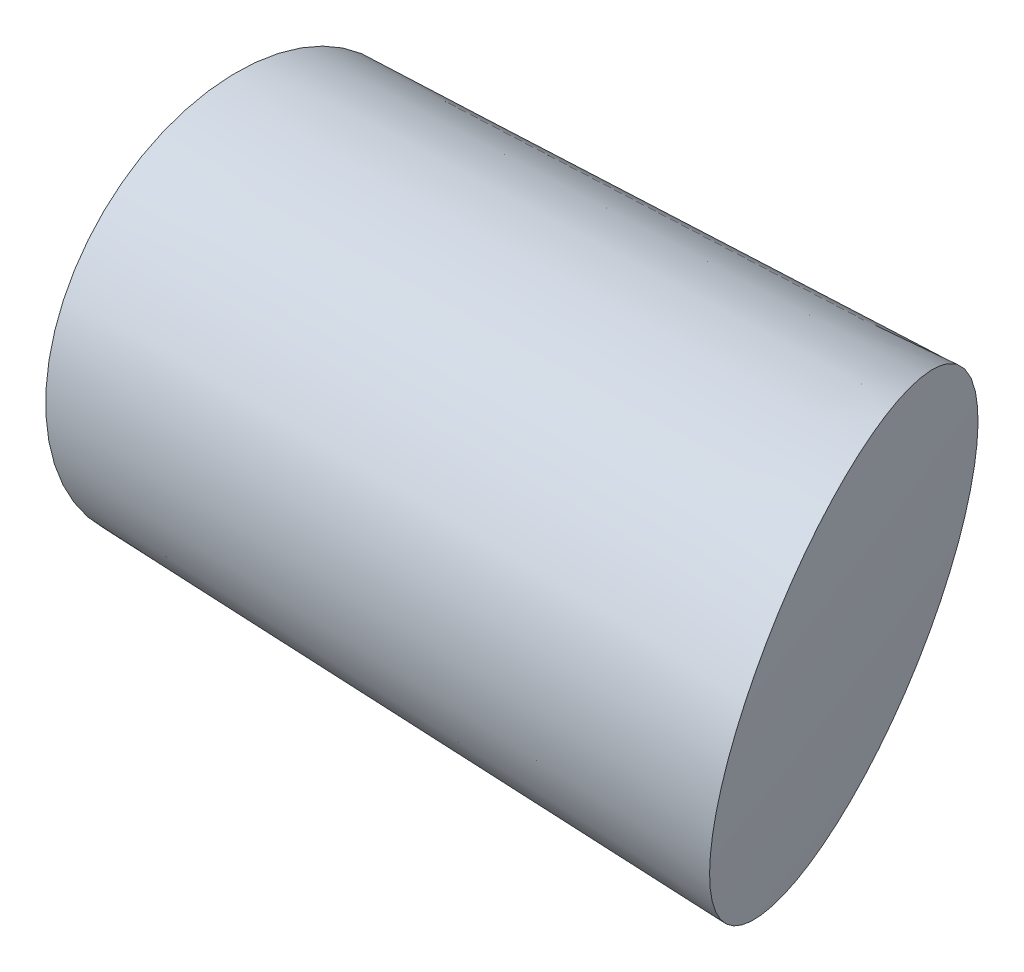
ISO-10303-21;
HEADER;
FILE_DESCRIPTION(('STEP AP214'),'2;1');
FILE_NAME('part.step','',(''),(''),'','','');
FILE_SCHEMA(('AUTOMOTIVE_DESIGN { 1 0 10303 214 1 1 1 1 }'));
ENDSEC;
DATA;
#1=APPLICATION_CONTEXT('core data for automotive mechanical design processes');
#2=APPLICATION_PROTOCOL_DEFINITION('international standard','automotive_design',2000,#1);
#3=PRODUCT_CONTEXT('',#1,'mechanical');
#4=PRODUCT('Part','Part','',(#3));
#5=PRODUCT_RELATED_PRODUCT_CATEGORY('part','',(#4));
#6=PRODUCT_DEFINITION_FORMATION('','',#4);
#7=PRODUCT_DEFINITION_CONTEXT('part definition',#1,'design');
#8=PRODUCT_DEFINITION('design','',#6,#7);
#9=PRODUCT_DEFINITION_SHAPE('','',#8);
#10=(LENGTH_UNIT() NAMED_UNIT(*) SI_UNIT(.MILLI.,.METRE.));
#11=(NAMED_UNIT(*) PLANE_ANGLE_UNIT() SI_UNIT($,.RADIAN.));
#12=(NAMED_UNIT(*) SI_UNIT($,.STERADIAN.) SOLID_ANGLE_UNIT());
#13=UNCERTAINTY_MEASURE_WITH_UNIT(LENGTH_MEASURE(1.E-05),#10,'distance_accuracy_value','');
#14=(GEOMETRIC_REPRESENTATION_CONTEXT(3) GLOBAL_UNCERTAINTY_ASSIGNED_CONTEXT((#13)) GLOBAL_UNIT_ASSIGNED_CONTEXT((#10,
#11,#12)) REPRESENTATION_CONTEXT('',''));
#15=CARTESIAN_POINT('',(0.,0.,0.));
#16=DIRECTION('',(0.,0.,1.));
#17=DIRECTION('',(1.,0.,0.));
#18=AXIS2_PLACEMENT_3D('',#15,#16,#17);
#19=CARTESIAN_POINT('',(179.320337841359,95.7593495012203,0.184037288881903));
#20=CARTESIAN_POINT('',(179.320239723515,95.760214114572,0.122691525921269));
#21=CARTESIAN_POINT('',(179.320141605671,95.7610787279237,0.0613457629606337));
#22=CARTESIAN_POINT('',(179.310231703382,95.8484046764461,-6.13457629606349));
#23=CARTESIAN_POINT('',(178.476616058903,95.9749337579072,-9.08435945500562));
#24=CARTESIAN_POINT('',(175.97364788942,96.1051535254976,-10.009742754146));
#25=CARTESIAN_POINT('',(175.947295778844,96.1065245240411,-10.0194855080976));
#26=CARTESIAN_POINT('',(175.920943668268,96.1078955225846,-10.0292282620493));
#27=CARTESIAN_POINT('',(179.31685623577,95.5062330008136,0.183936354268494));
#28=CARTESIAN_POINT('',(179.316790823874,95.5068094097147,0.122624236178996));
#29=CARTESIAN_POINT('',(179.316725411977,95.5073858186158,0.0613121180894974));
#30=CARTESIAN_POINT('',(179.310118810451,95.5656031176307,-6.13121180894982));
#31=CARTESIAN_POINT('',(178.471386634521,95.6499558386048,-9.09100481577225));
#32=CARTESIAN_POINT('',(175.973703532429,95.7367690169984,-10.0096720449849));
#33=CARTESIAN_POINT('',(175.947407064862,95.7376830160274,-10.0193440898402));
#34=CARTESIAN_POINT('',(175.921110597295,95.7385970150564,-10.0290161346955));
#35=CARTESIAN_POINT('',(179.313374630181,95.2531165004068,0.183835419655084));
#36=CARTESIAN_POINT('',(179.313341924232,95.2534047048574,0.122556946436723));
#37=CARTESIAN_POINT('',(179.313309218284,95.2536929093079,0.0612784732183612));
#38=CARTESIAN_POINT('',(179.31000591752,95.2828015588154,-6.12784732183616));
#39=CARTESIAN_POINT('',(178.466157210138,95.3249779193024,-9.09765017653888));
#40=CARTESIAN_POINT('',(175.973759175438,95.3683845084992,-10.0096013358238));
#41=CARTESIAN_POINT('',(175.94751835088,95.3688415080137,-10.0192026715828));
#42=CARTESIAN_POINT('',(175.921277526322,95.3692985075282,-10.0288040073418));
#43=CARTESIAN_POINT('',(179.299013007124,94.2090109362289,0.18341906437477));
#44=CARTESIAN_POINT('',(179.299115213212,94.2081102973209,0.122279376249847));
#45=CARTESIAN_POINT('',(179.2992174193,94.2072096584129,0.0611396881249241));
#46=CARTESIAN_POINT('',(179.309540234181,94.1162451287022,-6.11396881249228));
#47=CARTESIAN_POINT('',(178.44458583456,93.98444400218,-9.12506228970122));
#48=CARTESIAN_POINT('',(175.97398870285,93.8487984109399,-10.0093096605343));
#49=CARTESIAN_POINT('',(175.947977405704,93.8473702874572,-10.018619321271));
#50=CARTESIAN_POINT('',(175.921966108558,93.8459421639744,-10.0279289820077));
#51=CARTESIAN_POINT('',(179.297688771262,92.6266734184361,0.186237597628298));
#52=CARTESIAN_POINT('',(179.297920203992,92.6239932699078,0.124158398418865));
#53=CARTESIAN_POINT('',(179.298151636721,92.6213131213796,0.0620791992094317));
#54=CARTESIAN_POINT('',(179.321526342417,92.3506181200275,-6.20791992094334));
#55=CARTESIAN_POINT('',(178.419524826648,91.957927997574,-9.36453261538096));
#56=CARTESIAN_POINT('',(175.97425536124,91.5539518315239,-10.3231837447634));
#57=CARTESIAN_POINT('',(175.948510722484,91.5496986313723,-10.3332767538847));
#58=CARTESIAN_POINT('',(175.922766083729,91.5454454312208,-10.3433697630061));
#59=CARTESIAN_POINT('',(179.35957448773,90.2525842129129,0.196425885249977));
#60=CARTESIAN_POINT('',(179.359765102874,90.2477072970523,0.130950590166652));
#61=CARTESIAN_POINT('',(179.359955718019,90.2428303811917,0.0654752950833268));
#62=CARTESIAN_POINT('',(179.379207847659,89.7502618792728,-6.54752950833252));
#63=CARTESIAN_POINT('',(178.405692528753,89.0037801383462,-10.065051511361));
#64=CARTESIAN_POINT('',(175.974402542004,88.2471998346621,-11.3366020123975));
#65=CARTESIAN_POINT('',(175.948805084012,88.2392342967599,-11.3499893338243));
#66=CARTESIAN_POINT('',(175.923207626021,88.2312687588576,-11.3633766552512));
#67=CARTESIAN_POINT('',(179.487896947503,87.8798833437328,0.210046179333926));
#68=CARTESIAN_POINT('',(179.487802986571,87.8731973423953,0.140030786222618));
#69=CARTESIAN_POINT('',(179.487709025639,87.8665113410579,0.0700153931113102));
#70=CARTESIAN_POINT('',(179.478218971518,87.1912252059778,-7.0015393111308));
#71=CARTESIAN_POINT('',(178.416509975362,86.122113444057,-10.9614290022923));
#72=CARTESIAN_POINT('',(175.974287440373,85.0541063391589,-12.6619599836971));
#73=CARTESIAN_POINT('',(175.948574880749,85.0428619926798,-12.6798637593048));
#74=CARTESIAN_POINT('',(175.922862321126,85.0316176462006,-12.6977675349125));
#75=CARTESIAN_POINT('',(179.749317080231,84.7211682382065,0.231093606619197));
#76=CARTESIAN_POINT('',(179.748512625675,84.7124685048417,0.154062404412798));
#77=CARTESIAN_POINT('',(179.74770817112,84.7037687714769,0.0770312022063989));
#78=CARTESIAN_POINT('',(179.666458260988,83.8250957016303,-7.7031202206399));
#79=CARTESIAN_POINT('',(178.46437823144,82.3584566862005,-12.3206657414968));
#80=CARTESIAN_POINT('',(175.973778104429,80.9179479678816,-14.6910031946837));
#81=CARTESIAN_POINT('',(175.947556208862,80.9027817961766,-14.7159589234181));
#82=CARTESIAN_POINT('',(175.921334313295,80.8876156244716,-14.7409146521525));
#83=CARTESIAN_POINT('',(180.14883428544,81.5743967974306,0.254913355292645));
#84=CARTESIAN_POINT('',(180.14681367768,81.5640823883875,0.169942236861764));
#85=CARTESIAN_POINT('',(180.144793069921,81.5537679793444,0.0849711184308833));
#86=CARTESIAN_POINT('',(179.940711686194,80.5120126659906,-8.49711184308807));
#87=CARTESIAN_POINT('',(178.563281980309,78.6819541971733,-13.8365350812361));
#88=CARTESIAN_POINT('',(175.972725731972,76.9126969276965,-16.9708678022374));
#89=CARTESIAN_POINT('',(175.945451463949,76.8940695780679,-17.0038671361692));
#90=CARTESIAN_POINT('',(175.918177195925,76.8754422284392,-17.0368664701009));
#91=CARTESIAN_POINT('',(180.682957076427,78.4478025029072,0.280054343935183));
#92=CARTESIAN_POINT('',(180.679228120871,78.4360394499658,0.186702895956789));
#93=CARTESIAN_POINT('',(180.675499165314,78.4242763970243,0.0933514479783945));
#94=CARTESIAN_POINT('',(180.298874654083,77.2362080499361,-9.3351447978394));
#95=CARTESIAN_POINT('',(178.711796467482,75.0590430997608,-15.4259875601082));
#96=CARTESIAN_POINT('',(175.971145482917,72.9806694682737,-19.3694878297363));
#97=CARTESIAN_POINT('',(175.942290965837,72.9587876351675,-19.4110063581891));
#98=CARTESIAN_POINT('',(175.913436448758,72.9369058020612,-19.4525248866418));
#99=CARTESIAN_POINT('',(181.146739635946,76.1140332129099,0.299501106901493));
#100=CARTESIAN_POINT('',(181.141498437257,76.1012474988851,0.199667404600996));
#101=CARTESIAN_POINT('',(181.136257238568,76.0884617848602,0.0998337023004997));
#102=CARTESIAN_POINT('',(180.606896170939,74.797104668346,-9.98337023004968));
#103=CARTESIAN_POINT('',(178.846456636891,72.3661585156109,-16.6509857151081));
#104=CARTESIAN_POINT('',(175.969712648924,70.0636812616895,-21.2215700348593));
#105=CARTESIAN_POINT('',(175.939425297853,70.0394399884949,-21.2696907200756));
#106=CARTESIAN_POINT('',(175.909137946782,70.0151987153004,-21.317811405292));
#107=CARTESIAN_POINT('',(181.669600335133,73.7926606125094,0.319207371721182));
#108=CARTESIAN_POINT('',(181.662631026038,73.7788527315476,0.212804914480788));
#109=CARTESIAN_POINT('',(181.655661716943,73.7650448505858,0.106402457240395));
#110=CARTESIAN_POINT('',(180.951761498333,72.3704488734477,-10.6402457240393));
#111=CARTESIAN_POINT('',(179.002860045207,69.6874526294797,-17.8899295846978));
#112=CARTESIAN_POINT('',(175.968048458831,67.1620626324504,-23.0966049891868));
#113=CARTESIAN_POINT('',(175.936096917666,67.135474457155,-23.151422660328));
#114=CARTESIAN_POINT('',(175.904145376502,67.1088862818597,-23.2062403314692));
#115=CARTESIAN_POINT('',(182.435255657851,70.7137830284242,0.344992255778418));
#116=CARTESIAN_POINT('',(182.425731867935,70.6984333356769,0.229994837185612));
#117=CARTESIAN_POINT('',(182.416208078019,70.6830836429297,0.114997418592806));
#118=CARTESIAN_POINT('',(181.454305296507,69.1327646754583,-11.4997418592806));
#119=CARTESIAN_POINT('',(179.236613881136,66.102666797379,-19.5124736250272));
#120=CARTESIAN_POINT('',(175.965561231588,63.2633082710742,-25.5510678667283));
#121=CARTESIAN_POINT('',(175.931122463181,63.2334145270139,-25.6146442657893));
#122=CARTESIAN_POINT('',(175.896683694773,63.2035207829536,-25.6782206648503));
#123=CARTESIAN_POINT('',(183.501533426331,66.8952690777941,0.374524402186752));
#124=CARTESIAN_POINT('',(183.488417452522,66.8773190281757,0.249682934791168));
#125=CARTESIAN_POINT('',(183.475301478714,66.8593689785573,0.124841467395585));
#126=CARTESIAN_POINT('',(182.150588124061,65.0464139670973,-12.4841467395583));
#127=CARTESIAN_POINT('',(179.569007921936,61.5366653409081,-21.3833928959682));
#128=CARTESIAN_POINT('',(175.962024436094,58.2389600045546,-28.3714598808113));
#129=CARTESIAN_POINT('',(175.924048872192,58.2042406274847,-28.4450326557835));
#130=CARTESIAN_POINT('',(175.886073308291,58.1695212504149,-28.5186054307556));
#131=CARTESIAN_POINT('',(184.863636662741,62.3401215379093,0.404558842889708));
#132=CARTESIAN_POINT('',(184.845907397354,62.3180160374998,0.269705895259806));
#133=CARTESIAN_POINT('',(184.828178131967,62.2959105370903,0.134852947629903));
#134=CARTESIAN_POINT('',(183.037522327883,60.0632549957304,-13.4852947629902));
#135=CARTESIAN_POINT('',(179.998460884842,55.9060414516423,-23.3153582527551));
#136=CARTESIAN_POINT('',(175.957454897782,51.9559982641663,-31.2612678292801));
#137=CARTESIAN_POINT('',(175.914909795568,51.9144108496219,-31.3449251008104));
#138=CARTESIAN_POINT('',(175.872364693354,51.8728234350775,-31.4285823723407));
#139=CARTESIAN_POINT('',(185.979193006329,58.540308371435,0.424046298602275));
#140=CARTESIAN_POINT('',(185.957688824085,58.5139999864224,0.282697532401517));
#141=CARTESIAN_POINT('',(185.93618464184,58.4876916014099,0.141348766200758));
#142=CARTESIAN_POINT('',(183.764262235122,55.8305447151425,-14.1348766200758));
#143=CARTESIAN_POINT('',(180.349519501158,51.0813708850248,-24.6054585942461));
#144=CARTESIAN_POINT('',(175.953719504303,46.5138753127562,-33.1631175824054));
#145=CARTESIAN_POINT('',(175.907439008611,46.4657871469367,-33.2532155623461));
#146=CARTESIAN_POINT('',(175.861158512918,46.4176989811172,-33.3433135422868));
#147=CARTESIAN_POINT('',(186.768986149782,55.4735899432799,0.435382914505368));
#148=CARTESIAN_POINT('',(186.744834329219,55.4436077109046,0.290255276336913));
#149=CARTESIAN_POINT('',(186.720682508656,55.4136254785292,0.145127638168459));
#150=CARTESIAN_POINT('',(184.281348631834,52.385420008619,-14.5127638168454));
#151=CARTESIAN_POINT('',(180.593136877377,47.1400205183786,-25.3926490957045));
#152=CARTESIAN_POINT('',(175.951127325345,42.0470775805006,-34.2964207508572));
#153=CARTESIAN_POINT('',(175.902254650693,41.9934573239222,-34.3901627241109));
#154=CARTESIAN_POINT('',(175.853381976042,41.9398370673437,-34.4839046973646));
#155=CARTESIAN_POINT('',(187.455182311421,52.3830961194043,0.443476779985051));
#156=CARTESIAN_POINT('',(187.428758842578,52.3492982635544,0.295651186656701));
#157=CARTESIAN_POINT('',(187.402335373735,52.3155004077046,0.147825593328351));
#158=CARTESIAN_POINT('',(184.733565020598,48.9019169668697,-14.782559332835));
#159=CARTESIAN_POINT('',(180.799129164578,43.1496982976652,-25.9933016684416));
#160=CARTESIAN_POINT('',(175.948935491245,37.5167893715027,-35.1339000188614));
#161=CARTESIAN_POINT('',(175.897870982494,37.4574841671075,-35.2301353850943));
#162=CARTESIAN_POINT('',(175.846806473743,37.3981789627123,-35.3263707513273));
#163=CARTESIAN_POINT('',(188.105508117851,48.4791458825052,0.446750483580614));
#164=CARTESIAN_POINT('',(188.07699835425,48.4403828032049,0.29783365572041));
#165=CARTESIAN_POINT('',(188.048488590649,48.4016197239047,0.148916827860206));
#166=CARTESIAN_POINT('',(185.169002466931,44.4865487145831,-14.8916827860204));
#167=CARTESIAN_POINT('',(180.981195144611,38.0855142895933,-26.3507123663262));
#168=CARTESIAN_POINT('',(175.9469982419,31.7571571547851,-35.5566302697493));
#169=CARTESIAN_POINT('',(175.893996483804,31.69053003223,-35.6535533427236));
#170=CARTESIAN_POINT('',(175.840994725708,31.6239029096748,-35.7504764156979));
#171=CARTESIAN_POINT('',(188.536021323112,43.7497341824,0.436876927798753));
#172=CARTESIAN_POINT('',(188.506280141374,43.7052317407423,0.291251285199171));
#173=CARTESIAN_POINT('',(188.476538959636,43.6607292990847,0.145625642599588));
#174=CARTESIAN_POINT('',(185.472679604097,39.1659826916659,-14.5625642599583));
#175=CARTESIAN_POINT('',(181.072147740157,31.9988994335269,-25.9869351945906));
#176=CARTESIAN_POINT('',(175.946030472654,24.8558460727332,-34.8057447462999));
#177=CARTESIAN_POINT('',(175.892060945313,24.7806415478385,-34.898592209279));
#178=CARTESIAN_POINT('',(175.838091417971,24.7054370229437,-34.991439672258));
#179=CARTESIAN_POINT('',(188.621293593446,38.9985715914568,0.41102705648737));
#180=CARTESIAN_POINT('',(188.591577916748,38.9495517914533,0.274018037658249));
#181=CARTESIAN_POINT('',(188.561862240049,38.9005319914499,0.137009018829127));
#182=CARTESIAN_POINT('',(185.560578893477,33.9495321911022,-13.7009018829121));
#183=CARTESIAN_POINT('',(181.036938483305,26.1001875986502,-24.7062954566062));
#184=CARTESIAN_POINT('',(175.946405112165,18.2625158538362,-32.5989915431999));
#185=CARTESIAN_POINT('',(175.892810224335,18.1799981474608,-32.6820885647887));
#186=CARTESIAN_POINT('',(175.839215336505,18.0974804410853,-32.7651855863774));
#187=CARTESIAN_POINT('',(188.384141922687,34.2455000702239,0.369503390993638));
#188=CARTESIAN_POINT('',(188.355627526485,34.1944133754301,0.246335593995761));
#189=CARTESIAN_POINT('',(188.327113130284,34.1433266806363,0.123167796997883));
#190=CARTESIAN_POINT('',(185.447159113934,28.9835705064628,-12.3167796997878));
#191=CARTESIAN_POINT('',(180.883525634274,20.6233994174228,-22.5272063493302));
#192=CARTESIAN_POINT('',(175.948037481602,12.3341992724398,-28.964710267299));
#193=CARTESIAN_POINT('',(175.896074963209,12.2469277196214,-29.0324865247628));
#194=CARTESIAN_POINT('',(175.844112444815,12.159656166803,-29.1002627822267));
#195=CARTESIAN_POINT('',(187.858184577812,29.5059742198807,0.315411089303516));
#196=CARTESIAN_POINT('',(187.831926916091,29.4560307106992,0.210274059535679));
#197=CARTESIAN_POINT('',(187.80566925437,29.4060872015178,0.105137029767843));
#198=CARTESIAN_POINT('',(185.153645420517,24.3617927741863,-10.5137029767837));
#199=CARTESIAN_POINT('',(180.623784828973,15.7157797145001,-19.6294449974072));
#200=CARTESIAN_POINT('',(175.950801219808,7.29377015944779,-24.1870197107629));
#201=CARTESIAN_POINT('',(175.90160243962,7.20510034343837,-24.2350034263644));
#202=CARTESIAN_POINT('',(175.852403659432,7.11643052742894,-24.2829871419658));
#203=CARTESIAN_POINT('',(187.080619573174,24.7911792432987,0.252644900952354));
#204=CARTESIAN_POINT('',(187.057540795512,24.7456044231843,0.168429933968238));
#205=CARTESIAN_POINT('',(187.034462017851,24.7000296030698,0.0842149669841222));
#206=CARTESIAN_POINT('',(184.70350547405,20.0969727715102,-8.42149669841161));
#207=CARTESIAN_POINT('',(180.270889996125,11.3895287702404,-16.238249857114));
#208=CARTESIAN_POINT('',(175.954556151309,3.15384657224501,-18.6220997672373));
#209=CARTESIAN_POINT('',(175.909112302623,3.06713847479691,-18.6471977597702));
#210=CARTESIAN_POINT('',(175.863668453937,2.9804303773488,-18.6722957523031));
#211=CARTESIAN_POINT('',(186.418552881704,21.6691348919108,0.207079090190809));
#212=CARTESIAN_POINT('',(186.398121977882,21.6283569833582,0.138052726793874));
#213=CARTESIAN_POINT('',(186.37769107406,21.5875790748056,0.0690263633969403));
#214=CARTESIAN_POINT('',(184.31416978805,17.4690103109952,-6.90263633969341));
#215=CARTESIAN_POINT('',(179.982034606823,8.84975260740575,-13.7678189913936));
#216=CARTESIAN_POINT('',(175.957629679454,0.923414611188425,-14.5759065021019));
#217=CARTESIAN_POINT('',(175.915259358911,0.839963395993413,-14.5844143256119));
#218=CARTESIAN_POINT('',(175.872889038369,0.756512180798402,-14.5929221491219));
#219=CARTESIAN_POINT('',(186.056982227848,20.1139644556955,0.183706863396939));
#220=CARTESIAN_POINT('',(186.037988151899,20.075976303797,0.122471242264628));
#221=CARTESIAN_POINT('',(186.018994075949,20.0379881518985,0.0612356211323165));
#222=CARTESIAN_POINT('',(184.100592405073,16.2011848101491,-6.12356211323112));
#223=CARTESIAN_POINT('',(179.82610913476,7.65221826952447,-12.5));
#224=CARTESIAN_POINT('',(175.959288784129,-0.0814224317345808,-12.5));
#225=CARTESIAN_POINT('',(175.918577568261,-0.162844863469092,-12.5));
#226=CARTESIAN_POINT('',(175.877866352394,-0.244267295203604,-12.5));
#227=B_SPLINE_SURFACE_WITH_KNOTS('',3,3,((#19,#20,#21,#22,#23,#24,#25,#26),(#27,#28,#29,#30,#31,
#32,#33,#34),(#35,#36,#37,#38,#39,#40,#41,#42),(#43,#44,#45,#46,#47,#48,#49,#50),(#51,#52,#53,
#54,#55,#56,#57,#58),(#59,#60,#61,#62,#63,#64,#65,#66),(#67,#68,#69,#70,#71,#72,#73,#74),(#75,
#76,#77,#78,#79,#80,#81,#82),(#83,#84,#85,#86,#87,#88,#89,#90),(#91,#92,#93,#94,#95,#96,#97,
#98),(#99,#100,#101,#102,#103,#104,#105,#106),(#107,#108,#109,#110,#111,#112,#113,#114),(#115,
#116,#117,#118,#119,#120,#121,#122),(#123,#124,#125,#126,#127,#128,#129,#130),(#131,#132,#133,
#134,#135,#136,#137,#138),(#139,#140,#141,#142,#143,#144,#145,#146),(#147,#148,#149,#150,#151,
#152,#153,#154),(#155,#156,#157,#158,#159,#160,#161,#162),(#163,#164,#165,#166,#167,#168,#169,
#170),(#171,#172,#173,#174,#175,#176,#177,#178),(#179,#180,#181,#182,#183,#184,#185,#186),(#187,
#188,#189,#190,#191,#192,#193,#194),(#195,#196,#197,#198,#199,#200,#201,#202),(#203,#204,#205,
#206,#207,#208,#209,#210),(#211,#212,#213,#214,#215,#216,#217,#218),(#219,#220,#221,#222,#223,
#224,#225,#226)),.UNSPECIFIED.,.F.,.F.,.F.,(4,2,1,1,1,1,1,1,1,1,1,1,1,1,1,1,1,1,1,1,1,1,4),(4,2,
2,4),(-0.01,0.,0.03125,0.0625,0.09375,0.125,0.1875,0.21875,0.25,0.28125,0.3125,0.375,0.4375,0.5,
0.53125,0.5625,0.625,0.6875,0.75,0.8125,0.875,0.9375,1.),(-0.01,0.,1.,1.01064036974204),.UNSPECIFIED.);
#228=OFFSET_SURFACE('',#227,-1.,.F.);
#229=CARTESIAN_POINT('',(177.496429149504,24.0584655520757,-28.4985003943479));
#230=CARTESIAN_POINT('',(177.427308066725,23.9661197163714,-28.6326552616128));
#231=CARTESIAN_POINT('',(177.359274795637,23.8616337263342,-28.759182397461));
#232=CARTESIAN_POINT('',(177.227320843588,23.630616164212,-28.9930481034327));
#233=CARTESIAN_POINT('',(177.163404536803,23.5040616571785,-29.1003664731594));
#234=CARTESIAN_POINT('',(177.041535097025,23.2314700032405,-29.2921119060031));
#235=CARTESIAN_POINT('',(176.983598019555,23.0853827006794,-29.3764782823183));
#236=CARTESIAN_POINT('',(176.875945043,22.777846690609,-29.5181205673113));
#237=CARTESIAN_POINT('',(176.826224674427,22.6164064101676,-29.5754112356057));
#238=CARTESIAN_POINT('',(176.739814320001,22.293668199409,-29.6569605909619));
#239=CARTESIAN_POINT('',(176.702497687622,22.1330112951423,-29.6830846566296));
#240=CARTESIAN_POINT('',(176.638305096899,21.8075505312857,-29.7066927434015));
#241=CARTESIAN_POINT('',(176.611423470391,21.642748974968,-29.7041923355307));
#242=CARTESIAN_POINT('',(176.570965416904,21.3280261461247,-29.6711148869389));
#243=CARTESIAN_POINT('',(176.556489541673,21.1779783306313,-29.6428224083457));
#244=CARTESIAN_POINT('',(176.537882212749,20.8839883278393,-29.5617614441983));
#245=CARTESIAN_POINT('',(176.533747173659,20.7400440413336,-29.509001449598));
#246=CARTESIAN_POINT('',(176.535892869596,20.4696315822822,-29.3836994425305));
#247=CARTESIAN_POINT('',(176.541677087983,20.3426540345219,-29.3122436442196));
#248=CARTESIAN_POINT('',(176.562466422184,20.1019432736173,-29.1508062006901));
#249=CARTESIAN_POINT('',(176.577471019599,19.9882093163034,-29.060825597185));
#250=CARTESIAN_POINT('',(176.616147761347,19.7767752583223,-28.8650892943253));
#251=CARTESIAN_POINT('',(176.639828559842,19.6790913082946,-28.7593179069317));
#252=CARTESIAN_POINT('',(176.695034025779,19.5019942795606,-28.5352926382401));
#253=CARTESIAN_POINT('',(176.726559973747,19.422584187681,-28.4170367209712));
#254=CARTESIAN_POINT('',(176.7980664735,19.2802262293436,-28.1658151116699));
#255=CARTESIAN_POINT('',(176.838365608638,19.2181882584878,-28.0324255362539));
#256=CARTESIAN_POINT('',(176.925260389476,19.1162887727191,-27.7593955827499));
#257=CARTESIAN_POINT('',(176.971857864043,19.0764337163844,-27.6197533969806));
#258=CARTESIAN_POINT('',(177.073658878221,19.0169525352516,-27.3275648531341));
#259=CARTESIAN_POINT('',(177.129240284506,18.9989866519136,-27.174812510556));
#260=CARTESIAN_POINT('',(177.244740657716,18.9882132873821,-26.8700728872183));
#261=CARTESIAN_POINT('',(177.304661097108,18.9954143862533,-26.7180858850711));
#262=CARTESIAN_POINT('',(177.43193853156,19.0355530372799,-26.4073567022028));
#263=CARTESIAN_POINT('',(177.499517883935,19.0703525959417,-26.2489449707317));
#264=CARTESIAN_POINT('',(177.636277926987,19.1665529849208,-25.9411325471221));
#265=CARTESIAN_POINT('',(177.705459098233,19.2279618989642,-25.7917346090327));
#266=CARTESIAN_POINT('',(177.847028566414,19.3792480753717,-25.4987986882347));
#267=CARTESIAN_POINT('',(177.919410631153,19.470355438066,-25.3558907761749));
#268=CARTESIAN_POINT('',(178.061984457832,19.6776300143097,-25.0882546573554));
#269=CARTESIAN_POINT('',(178.132175931056,19.7938005152881,-24.963528839066));
#270=CARTESIAN_POINT('',(178.268119157167,20.0482698561836,-24.7364837955932));
#271=CARTESIAN_POINT('',(178.333876085272,20.1865422442263,-24.6341381279499));
#272=CARTESIAN_POINT('',(178.458709335538,20.4818489876487,-24.4557197848399));
#273=CARTESIAN_POINT('',(178.51778749235,20.6388781660604,-24.37963988234));
#274=CARTESIAN_POINT('',(178.623682991409,20.9578564134041,-24.2610583175643));
#275=CARTESIAN_POINT('',(178.671007278447,21.1190147645735,-24.2168897742162));
#276=CARTESIAN_POINT('',(178.755393626093,21.4492332582222,-24.1581098434421));
#277=CARTESIAN_POINT('',(178.792462445561,21.6182881102226,-24.1434789490078));
#278=CARTESIAN_POINT('',(178.851659203256,21.9433402373079,-24.1454869347943));
#279=CARTESIAN_POINT('',(178.874820407159,22.099166345263,-24.1594684781118));
#280=CARTESIAN_POINT('',(178.909861015439,22.4074384276014,-24.2138243006974));
#281=CARTESIAN_POINT('',(178.92174649514,22.5598861789377,-24.2541843474908));
#282=CARTESIAN_POINT('',(178.933162679044,22.8452762947801,-24.3564380445468));
#283=CARTESIAN_POINT('',(178.93353313461,22.9788298479984,-24.4165415876293));
#284=CARTESIAN_POINT('',(178.924004796692,23.2345368651874,-24.5567942462595));
#285=CARTESIAN_POINT('',(178.9141077193,23.3566922305054,-24.6369400102994));
#286=CARTESIAN_POINT('',(178.88478022557,23.583892415669,-24.812864410364));
#287=CARTESIAN_POINT('',(178.865545254392,23.6892315923501,-24.9082967752929));
#288=CARTESIAN_POINT('',(178.818423876506,23.8832709177543,-25.1128961305251));
#289=CARTESIAN_POINT('',(178.790536375477,23.9719689595265,-25.2220648570838));
#290=CARTESIAN_POINT('',(178.725903008015,24.1341481291415,-25.4553931893197));
#291=CARTESIAN_POINT('',(178.688859132857,24.2069175131685,-25.5799664531454));
#292=CARTESIAN_POINT('',(178.628149457494,24.3004815645596,-25.7725754871678));
#293=CARTESIAN_POINT('',(178.607048089228,24.3290778297556,-25.8377582460247));
#294=CARTESIAN_POINT('',(178.563271717499,24.3810680357354,-25.9697115350752));
#295=CARTESIAN_POINT('',(178.540595612288,24.4044582850836,-26.0364831549843));
#296=CARTESIAN_POINT('',(178.466906313261,24.4698871288228,-26.2487820589615));
#297=CARTESIAN_POINT('',(178.413329446821,24.5023863363345,-26.3964634875024));
#298=CARTESIAN_POINT('',(178.301332590035,24.5430955412666,-26.6933493574704));
#299=CARTESIAN_POINT('',(178.242909889724,24.5512918522013,-26.8425546096191));
#300=CARTESIAN_POINT('',(178.15028942162,24.5456740113418,-27.0711753763662));
#301=CARTESIAN_POINT('',(178.117214822199,24.5402030847016,-27.1513406868064));
#302=CARTESIAN_POINT('',(178.050361908873,24.5224147622773,-27.3105424895494));
#303=CARTESIAN_POINT('',(178.016584250491,24.5101034913158,-27.3895799269025));
#304=CARTESIAN_POINT('',(177.948547184107,24.478785990079,-27.5460638174017));
#305=CARTESIAN_POINT('',(177.914287967981,24.4597823576053,-27.6235108755642));
#306=CARTESIAN_POINT('',(177.845500928139,24.4152434940945,-27.7763743971057));
#307=CARTESIAN_POINT('',(177.810973097341,24.389708090315,-27.8517908067229));
#308=CARTESIAN_POINT('',(177.72948204566,24.3219785205869,-28.026724480603));
#309=CARTESIAN_POINT('',(177.682492531208,24.2770932837231,-28.1252033275817));
#310=CARTESIAN_POINT('',(177.588984199892,24.1760893030259,-28.3164162809735));
#311=CARTESIAN_POINT('',(177.542465405075,24.1199700355487,-28.4091501193346));
#312=CARTESIAN_POINT('',(177.496429149504,24.0584655520757,-28.4985003943479));
#313=B_SPLINE_CURVE_WITH_KNOTS('',3,(#229,#230,#231,#232,#233,#234,#235,#236,#237,#238,#239,
#240,#241,#242,#243,#244,#245,#246,#247,#248,#249,#250,#251,#252,#253,#254,#255,#256,#257,#258,
#259,#260,#261,#262,#263,#264,#265,#266,#267,#268,#269,#270,#271,#272,#273,#274,#275,#276,#277,
#278,#279,#280,#281,#282,#283,#284,#285,#286,#287,#288,#289,#290,#291,#292,#293,#294,#295,#296,
#297,#298,#299,#300,#301,#302,#303,#304,#305,#306,#307,#308,#309,#310,#311,#312),.UNSPECIFIED.,
.T.,.F.,(4,2,2,2,2,2,2,2,2,2,2,2,2,2,2,2,2,2,2,2,2,2,2,2,2,2,2,2,2,2,2,2,2,2,2,2,2,2,2,2,2,4),
(0.,0.530390547489134,1.06133563051752,1.59367122149328,2.12571628791871,2.62400007872589,
3.12201282802472,3.57979233843453,4.03741310451957,4.47278999094627,4.90814240132171,
5.3439302457319,5.77978926831108,6.23541481246363,6.69117294315513,7.17969562736754,
7.66838487763704,8.1931765638174,8.71812778974,9.26839548500601,9.81873540055512,
10.3684215257647,10.9179562839008,11.4361652443369,11.9540318614255,12.4259850341737,
12.8976837754064,13.3348956232495,13.7720344083203,14.2003943395477,14.6288084693136,
15.0736080001904,15.2961487865932,15.5188468710556,15.9979729625685,16.4773688288395,
16.7378050794893,16.9980085112775,17.2581110499606,17.5182204681559,17.8714564919831,
18.2247089847834),.UNSPECIFIED.);
#314=CARTESIAN_POINT('',(177.496429149504,24.0584655520757,-28.4985003943479));
#315=VERTEX_POINT('',#314);
#316=EDGE_CURVE('E53',#315,#315,#313,.T.);
#317=ORIENTED_EDGE('',*,*,#316,.F.);
#318=EDGE_LOOP('',(#317));
#319=FACE_BOUND('',#318,.T.);
#320=ADVANCED_FACE('F30',(#319),#228,.T.);
#321=CARTESIAN_POINT('',(176.640933618788,21.75297505067,-26.9615067267441));
#322=DIRECTION('',(1.,0.,0.));
#323=DIRECTION('',(0.,0.832050294337844,-0.554700196225229));
#324=AXIS2_PLACEMENT_3D('',#321,#322,#323);
#325=PLANE('',#324);
#326=CARTESIAN_POINT('',(176.640933618788,21.75297505067,-26.9615067267441));
#327=DIRECTION('',(1.,0.,0.));
#328=DIRECTION('',(0.,-0.832050294337844,0.554700196225229));
#329=AXIS2_PLACEMENT_3D('',#326,#327,#328);
#330=CIRCLE('',#329,1.);
#331=CARTESIAN_POINT('',(176.640933618788,20.9209247563322,-26.4068065305189));
#332=VERTEX_POINT('',#331);
#333=EDGE_CURVE('E43',#332,#332,#330,.T.);
#334=ORIENTED_EDGE('',*,*,#333,.F.);
#335=EDGE_LOOP('',(#334));
#336=FACE_BOUND('',#335,.T.);
#337=ADVANCED_FACE('F77',(#336),#325,.F.);
#338=CARTESIAN_POINT('',(172.740933618788,21.75297505067,-26.9615067267441));
#339=DIRECTION('',(1.,0.,0.));
#340=DIRECTION('',(0.,0.832050294337844,-0.554700196225229));
#341=AXIS2_PLACEMENT_3D('',#338,#339,#340);
#342=CYLINDRICAL_SURFACE('',#341,1.);
#343=ORIENTED_EDGE('',*,*,#333,.T.);
#344=EDGE_LOOP('',(#343));
#345=FACE_BOUND('',#344,.T.);
#346=CARTESIAN_POINT('',(172.740933618788,21.75297505067,-26.9615067267441));
#347=DIRECTION('',(-1.,0.,0.));
#348=DIRECTION('',(0.,0.832050294337844,-0.554700196225229));
#349=AXIS2_PLACEMENT_3D('',#346,#347,#348);
#350=CIRCLE('',#349,1.);
#351=CARTESIAN_POINT('',(172.740933618788,22.5850253450079,-27.5162069229693));
#352=VERTEX_POINT('',#351);
#353=EDGE_CURVE('E39',#352,#352,#350,.F.);
#354=ORIENTED_EDGE('',*,*,#353,.F.);
#355=EDGE_LOOP('',(#354));
#356=FACE_BOUND('',#355,.T.);
#357=ADVANCED_FACE('F73',(#345,#356),#342,.F.);
#358=CARTESIAN_POINT('',(172.740933618788,21.75297505067,-26.9615067267441));
#359=DIRECTION('',(1.,0.,0.));
#360=DIRECTION('',(0.,0.832050294337844,-0.554700196225229));
#361=AXIS2_PLACEMENT_3D('',#358,#359,#360);
#362=PLANE('',#361);
#363=ORIENTED_EDGE('',*,*,#353,.T.);
#364=EDGE_LOOP('',(#363));
#365=FACE_BOUND('',#364,.T.);
#366=CARTESIAN_POINT('',(172.740933618788,21.75297505067,-26.9615067267441));
#367=DIRECTION('',(1.,0.,0.));
#368=DIRECTION('',(0.,-0.832050294337844,0.554700196225229));
#369=AXIS2_PLACEMENT_3D('',#366,#367,#368);
#370=CIRCLE('',#369,1.91882364313552);
#371=CARTESIAN_POINT('',(172.740933618788,20.1564172736167,-25.8971348753752));
#372=VERTEX_POINT('',#371);
#373=EDGE_CURVE('E10',#372,#372,#370,.T.);
#374=ORIENTED_EDGE('',*,*,#373,.F.);
#375=EDGE_LOOP('',(#374));
#376=FACE_BOUND('',#375,.T.);
#377=ADVANCED_FACE('F76',(#365,#376),#362,.F.);
#378=CARTESIAN_POINT('',(172.740933618788,21.75297505067,-26.9615067267441));
#379=DIRECTION('',(-1.,0.,0.));
#380=DIRECTION('',(0.,-0.832050294337844,0.554700196225229));
#381=AXIS2_PLACEMENT_3D('',#378,#379,#380);
#382=CONICAL_SURFACE('',#381,1.91882364313552,0.0261799387799149);
#383=CARTESIAN_POINT('',(169.740933618788,21.75297505067,-26.9615067267441));
#384=DIRECTION('',(-1.,0.,0.));
#385=DIRECTION('',(0.,0.,1.));
#386=AXIS2_PLACEMENT_3D('',#383,#384,#385);
#387=CIRCLE('',#386,1.99738140784308);
#388=CARTESIAN_POINT('',(169.740933618788,21.75297505067,-24.964125318901));
#389=VERTEX_POINT('',#388);
#390=EDGE_CURVE('E47',#389,#389,#387,.T.);
#391=ORIENTED_EDGE('',*,*,#390,.T.);
#392=EDGE_LOOP('',(#391));
#393=FACE_BOUND('',#392,.T.);
#394=ORIENTED_EDGE('',*,*,#373,.T.);
#395=EDGE_LOOP('',(#394));
#396=FACE_BOUND('',#395,.T.);
#397=ADVANCED_FACE('F71',(#393,#396),#382,.F.);
#398=CARTESIAN_POINT('',(169.740933618788,21.75297505067,-26.9615067267441));
#399=DIRECTION('',(-1.,0.,0.));
#400=DIRECTION('',(0.,-0.832050294337844,0.554700196225229));
#401=AXIS2_PLACEMENT_3D('',#398,#399,#400);
#402=PLANE('',#401);
#403=ORIENTED_EDGE('',*,*,#390,.F.);
#404=EDGE_LOOP('',(#403));
#405=FACE_BOUND('',#404,.T.);
#406=CARTESIAN_POINT('',(169.740933618788,21.75297505067,-26.9615067267441));
#407=DIRECTION('',(-1.,0.,0.));
#408=DIRECTION('',(0.,0.832050294337844,-0.554700196225229));
#409=AXIS2_PLACEMENT_3D('',#406,#407,#408);
#410=CIRCLE('',#409,2.5);
#411=CARTESIAN_POINT('',(169.740933618788,23.8331007865146,-28.3482572173072));
#412=VERTEX_POINT('',#411);
#413=EDGE_CURVE('E50',#412,#412,#410,.T.);
#414=ORIENTED_EDGE('',*,*,#413,.T.);
#415=EDGE_LOOP('',(#414));
#416=FACE_BOUND('',#415,.T.);
#417=ADVANCED_FACE('F67',(#405,#416),#402,.T.);
#418=CARTESIAN_POINT('',(169.740933618788,21.75297505067,-26.9615067267441));
#419=DIRECTION('',(1.,0.,0.));
#420=DIRECTION('',(0.,0.832050294337844,-0.554700196225229));
#421=AXIS2_PLACEMENT_3D('',#418,#419,#420);
#422=CONICAL_SURFACE('',#421,2.5,0.0349100451482289);
#423=ORIENTED_EDGE('',*,*,#316,.T.);
#424=EDGE_LOOP('',(#423));
#425=FACE_BOUND('',#424,.T.);
#426=ORIENTED_EDGE('',*,*,#413,.F.);
#427=EDGE_LOOP('',(#426));
#428=FACE_BOUND('',#427,.T.);
#429=ADVANCED_FACE('F63',(#425,#428),#422,.T.);
#430=CLOSED_SHELL('',(#320,#337,#357,#377,#397,#417,#429));
#431=MANIFOLD_SOLID_BREP('B2',#430);
#432=ADVANCED_BREP_SHAPE_REPRESENTATION('',(#18,#431),#14);
#433=SHAPE_DEFINITION_REPRESENTATION(#9,#432);
ENDSEC;
END-ISO-10303-21;
